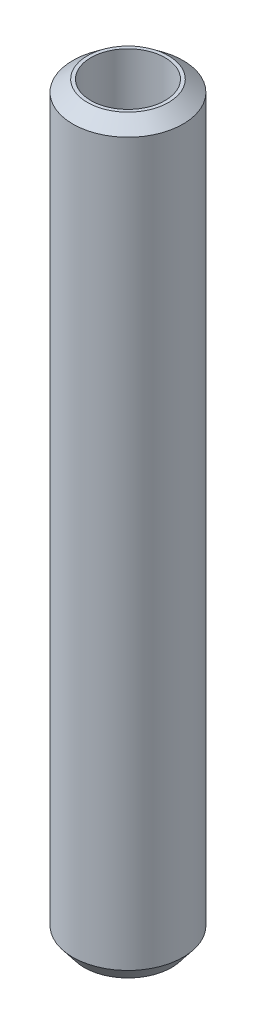
ISO-10303-21;
HEADER;
FILE_DESCRIPTION(('STEP AP214'),'2;1');
FILE_NAME('part.step','',(''),(''),'','','');
FILE_SCHEMA(('AUTOMOTIVE_DESIGN { 1 0 10303 214 1 1 1 1 }'));
ENDSEC;
DATA;
#1=APPLICATION_CONTEXT('core data for automotive mechanical design processes');
#2=APPLICATION_PROTOCOL_DEFINITION('international standard','automotive_design',2000,#1);
#3=PRODUCT_CONTEXT('',#1,'mechanical');
#4=PRODUCT('Part','Part','',(#3));
#5=PRODUCT_RELATED_PRODUCT_CATEGORY('part','',(#4));
#6=PRODUCT_DEFINITION_FORMATION('','',#4);
#7=PRODUCT_DEFINITION_CONTEXT('part definition',#1,'design');
#8=PRODUCT_DEFINITION('design','',#6,#7);
#9=PRODUCT_DEFINITION_SHAPE('','',#8);
#10=(LENGTH_UNIT() NAMED_UNIT(*) SI_UNIT(.MILLI.,.METRE.));
#11=(NAMED_UNIT(*) PLANE_ANGLE_UNIT() SI_UNIT($,.RADIAN.));
#12=(NAMED_UNIT(*) SI_UNIT($,.STERADIAN.) SOLID_ANGLE_UNIT());
#13=UNCERTAINTY_MEASURE_WITH_UNIT(LENGTH_MEASURE(1.E-05),#10,'distance_accuracy_value','');
#14=(GEOMETRIC_REPRESENTATION_CONTEXT(3) GLOBAL_UNCERTAINTY_ASSIGNED_CONTEXT((#13)) GLOBAL_UNIT_ASSIGNED_CONTEXT((#10,
#11,#12)) REPRESENTATION_CONTEXT('',''));
#15=CARTESIAN_POINT('',(0.,0.,0.));
#16=DIRECTION('',(0.,0.,1.));
#17=DIRECTION('',(1.,0.,0.));
#18=AXIS2_PLACEMENT_3D('',#15,#16,#17);
#19=CARTESIAN_POINT('',(0.,372.887928078202,0.));
#20=DIRECTION('',(0.,-1.,0.));
#21=DIRECTION('',(0.,0.,-1.));
#22=AXIS2_PLACEMENT_3D('',#19,#20,#21);
#23=CYLINDRICAL_SURFACE('',#22,27.5);
#24=CARTESIAN_POINT('',(0.,367.202776102698,0.));
#25=DIRECTION('',(0.,1.,0.));
#26=DIRECTION('',(0.,0.,1.));
#27=AXIS2_PLACEMENT_3D('',#24,#25,#26);
#28=CIRCLE('',#27,27.5);
#29=CARTESIAN_POINT('',(0.,367.202776102698,27.5));
#30=VERTEX_POINT('',#29);
#31=EDGE_CURVE('E50',#30,#30,#28,.F.);
#32=ORIENTED_EDGE('',*,*,#31,.T.);
#33=EDGE_LOOP('',(#32));
#34=FACE_BOUND('',#33,.T.);
#35=CARTESIAN_POINT('',(0.,7.28047694730993,0.));
#36=DIRECTION('',(0.,1.,0.));
#37=DIRECTION('',(0.,0.,1.));
#38=AXIS2_PLACEMENT_3D('',#35,#36,#37);
#39=CIRCLE('',#38,27.5);
#40=CARTESIAN_POINT('',(0.,7.28047694730993,27.5));
#41=VERTEX_POINT('',#40);
#42=EDGE_CURVE('E51',#41,#41,#39,.T.);
#43=ORIENTED_EDGE('',*,*,#42,.T.);
#44=EDGE_LOOP('',(#43));
#45=FACE_BOUND('',#44,.T.);
#46=ADVANCED_FACE('F39',(#34,#45),#23,.T.);
#47=CARTESIAN_POINT('',(0.,372.887928078202,0.));
#48=DIRECTION('',(0.,1.,0.));
#49=DIRECTION('',(0.,0.,1.));
#50=AXIS2_PLACEMENT_3D('',#47,#48,#49);
#51=PLANE('',#50);
#52=CARTESIAN_POINT('',(0.,372.887928078202,0.));
#53=DIRECTION('',(0.,1.,0.));
#54=DIRECTION('',(0.,0.,1.));
#55=AXIS2_PLACEMENT_3D('',#52,#53,#54);
#56=CIRCLE('',#55,20.21952305269);
#57=CARTESIAN_POINT('',(0.,372.887928078202,20.21952305269));
#58=VERTEX_POINT('',#57);
#59=EDGE_CURVE('E54',#58,#58,#56,.T.);
#60=ORIENTED_EDGE('',*,*,#59,.T.);
#61=EDGE_LOOP('',(#60));
#62=FACE_BOUND('',#61,.T.);
#63=CARTESIAN_POINT('',(0.,372.887928078202,0.));
#64=DIRECTION('',(0.,1.,0.));
#65=DIRECTION('',(0.,0.,1.));
#66=AXIS2_PLACEMENT_3D('',#63,#64,#65);
#67=CIRCLE('',#66,18.5375692251474);
#68=CARTESIAN_POINT('',(0.,372.887928078202,18.5375692251474));
#69=VERTEX_POINT('',#68);
#70=EDGE_CURVE('E58',#69,#69,#67,.T.);
#71=ORIENTED_EDGE('',*,*,#70,.F.);
#72=EDGE_LOOP('',(#71));
#73=FACE_BOUND('',#72,.T.);
#74=ADVANCED_FACE('F69',(#62,#73),#51,.T.);
#75=CARTESIAN_POINT('',(0.,0.,0.));
#76=DIRECTION('',(0.,1.,0.));
#77=DIRECTION('',(0.,0.,1.));
#78=AXIS2_PLACEMENT_3D('',#75,#76,#77);
#79=PLANE('',#78);
#80=CARTESIAN_POINT('',(0.,0.,0.));
#81=DIRECTION('',(0.,1.,0.));
#82=DIRECTION('',(0.,0.,1.));
#83=AXIS2_PLACEMENT_3D('',#80,#81,#82);
#84=CIRCLE('',#83,21.8148480244955);
#85=CARTESIAN_POINT('',(0.,0.,21.8148480244955));
#86=VERTEX_POINT('',#85);
#87=EDGE_CURVE('E10',#86,#86,#84,.F.);
#88=ORIENTED_EDGE('',*,*,#87,.T.);
#89=EDGE_LOOP('',(#88));
#90=FACE_BOUND('',#89,.T.);
#91=CARTESIAN_POINT('',(0.,0.,0.));
#92=DIRECTION('',(0.,1.,0.));
#93=DIRECTION('',(0.,0.,1.));
#94=AXIS2_PLACEMENT_3D('',#91,#92,#93);
#95=CIRCLE('',#94,18.5375692251474);
#96=CARTESIAN_POINT('',(0.,0.,18.5375692251474));
#97=VERTEX_POINT('',#96);
#98=EDGE_CURVE('E63',#97,#97,#95,.T.);
#99=ORIENTED_EDGE('',*,*,#98,.T.);
#100=EDGE_LOOP('',(#99));
#101=FACE_BOUND('',#100,.T.);
#102=ADVANCED_FACE('F75',(#90,#101),#79,.F.);
#103=CARTESIAN_POINT('',(0.,372.887928078202,0.));
#104=DIRECTION('',(0.,-1.,0.));
#105=DIRECTION('',(0.,0.,-1.));
#106=AXIS2_PLACEMENT_3D('',#103,#104,#105);
#107=CYLINDRICAL_SURFACE('',#106,18.5375692251474);
#108=ORIENTED_EDGE('',*,*,#70,.T.);
#109=EDGE_LOOP('',(#108));
#110=FACE_BOUND('',#109,.T.);
#111=ORIENTED_EDGE('',*,*,#98,.F.);
#112=EDGE_LOOP('',(#111));
#113=FACE_BOUND('',#112,.T.);
#114=ADVANCED_FACE('F70',(#110,#113),#107,.F.);
#115=CARTESIAN_POINT('',(0.,372.887928078202,0.));
#116=DIRECTION('',(0.,-1.,0.));
#117=DIRECTION('',(0.,0.,-1.));
#118=AXIS2_PLACEMENT_3D('',#115,#116,#117);
#119=CONICAL_SURFACE('',#118,20.21952305269,0.907825430922532);
#120=ORIENTED_EDGE('',*,*,#31,.F.);
#121=EDGE_LOOP('',(#120));
#122=FACE_BOUND('',#121,.T.);
#123=ORIENTED_EDGE('',*,*,#59,.F.);
#124=EDGE_LOOP('',(#123));
#125=FACE_BOUND('',#124,.T.);
#126=ADVANCED_FACE('F81',(#122,#125),#119,.T.);
#127=CARTESIAN_POINT('',(0.,7.28047694730993,0.));
#128=DIRECTION('',(0.,1.,0.));
#129=DIRECTION('',(0.,0.,1.));
#130=AXIS2_PLACEMENT_3D('',#127,#128,#129);
#131=CONICAL_SURFACE('',#130,27.5,0.66297089587236);
#132=ORIENTED_EDGE('',*,*,#87,.F.);
#133=EDGE_LOOP('',(#132));
#134=FACE_BOUND('',#133,.T.);
#135=ORIENTED_EDGE('',*,*,#42,.F.);
#136=EDGE_LOOP('',(#135));
#137=FACE_BOUND('',#136,.T.);
#138=ADVANCED_FACE('F45',(#134,#137),#131,.T.);
#139=CLOSED_SHELL('',(#46,#74,#102,#114,#126,#138));
#140=MANIFOLD_SOLID_BREP('B2',#139);
#141=ADVANCED_BREP_SHAPE_REPRESENTATION('',(#18,#140),#14);
#142=SHAPE_DEFINITION_REPRESENTATION(#9,#141);
ENDSEC;
END-ISO-10303-21;
